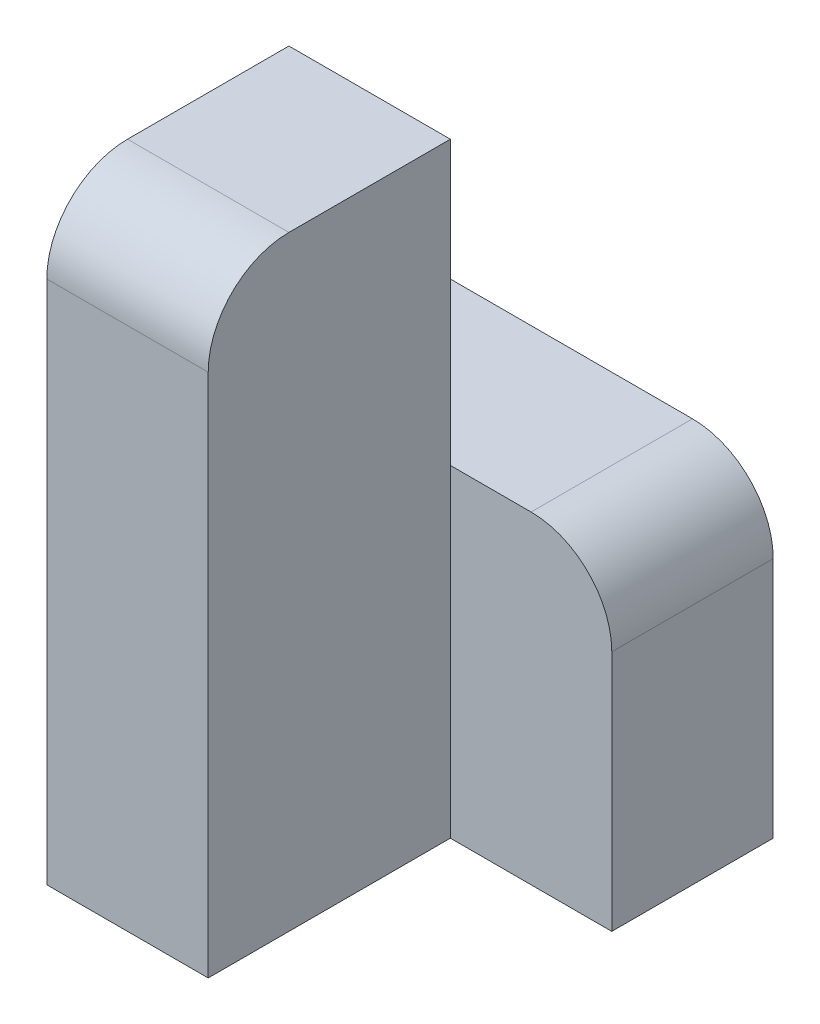
ISO-10303-21;
HEADER;
FILE_DESCRIPTION(('STEP AP214'),'2;1');
FILE_NAME('part.step','',(''),(''),'','','');
FILE_SCHEMA(('AUTOMOTIVE_DESIGN { 1 0 10303 214 1 1 1 1 }'));
ENDSEC;
DATA;
#1=APPLICATION_CONTEXT('core data for automotive mechanical design processes');
#2=APPLICATION_PROTOCOL_DEFINITION('international standard','automotive_design',2000,#1);
#3=PRODUCT_CONTEXT('',#1,'mechanical');
#4=PRODUCT('Part','Part','',(#3));
#5=PRODUCT_RELATED_PRODUCT_CATEGORY('part','',(#4));
#6=PRODUCT_DEFINITION_FORMATION('','',#4);
#7=PRODUCT_DEFINITION_CONTEXT('part definition',#1,'design');
#8=PRODUCT_DEFINITION('design','',#6,#7);
#9=PRODUCT_DEFINITION_SHAPE('','',#8);
#10=(LENGTH_UNIT() NAMED_UNIT(*) SI_UNIT(.MILLI.,.METRE.));
#11=(NAMED_UNIT(*) PLANE_ANGLE_UNIT() SI_UNIT($,.RADIAN.));
#12=(NAMED_UNIT(*) SI_UNIT($,.STERADIAN.) SOLID_ANGLE_UNIT());
#13=UNCERTAINTY_MEASURE_WITH_UNIT(LENGTH_MEASURE(1.E-05),#10,'distance_accuracy_value','');
#14=(GEOMETRIC_REPRESENTATION_CONTEXT(3) GLOBAL_UNCERTAINTY_ASSIGNED_CONTEXT((#13)) GLOBAL_UNIT_ASSIGNED_CONTEXT((#10,
#11,#12)) REPRESENTATION_CONTEXT('',''));
#15=CARTESIAN_POINT('',(0.,0.,0.));
#16=DIRECTION('',(0.,0.,1.));
#17=DIRECTION('',(1.,0.,0.));
#18=AXIS2_PLACEMENT_3D('',#15,#16,#17);
#19=CARTESIAN_POINT('',(-10.,0.,30.));
#20=DIRECTION('',(0.,-1.,0.));
#21=DIRECTION('',(1.,0.,0.));
#22=AXIS2_PLACEMENT_3D('',#19,#20,#21);
#23=PLANE('',#22);
#24=DIRECTION('',(0.,0.,-1.));
#25=VECTOR('',#24,1.);
#26=CARTESIAN_POINT('',(-30.,0.,30.));
#27=LINE('',#26,#25);
#28=CARTESIAN_POINT('',(-30.,0.,20.));
#29=VERTEX_POINT('',#28);
#30=CARTESIAN_POINT('',(-30.,0.,0.));
#31=VERTEX_POINT('',#30);
#32=EDGE_CURVE('E171',#29,#31,#27,.T.);
#33=ORIENTED_EDGE('',*,*,#32,.F.);
#34=DIRECTION('',(-1.,0.,0.));
#35=VECTOR('',#34,1.);
#36=CARTESIAN_POINT('',(-10.,0.,20.));
#37=LINE('',#36,#35);
#38=CARTESIAN_POINT('',(-10.,0.,20.));
#39=VERTEX_POINT('',#38);
#40=EDGE_CURVE('E43',#29,#39,#37,.F.);
#41=ORIENTED_EDGE('',*,*,#40,.T.);
#42=DIRECTION('',(0.,0.,-1.));
#43=VECTOR('',#42,1.);
#44=CARTESIAN_POINT('',(-10.,0.,30.));
#45=LINE('',#44,#43);
#46=CARTESIAN_POINT('',(-10.,0.,0.));
#47=VERTEX_POINT('',#46);
#48=EDGE_CURVE('E158',#39,#47,#45,.T.);
#49=ORIENTED_EDGE('',*,*,#48,.T.);
#50=DIRECTION('',(-1.,0.,0.));
#51=VECTOR('',#50,1.);
#52=CARTESIAN_POINT('',(-10.,0.,0.));
#53=LINE('',#52,#51);
#54=EDGE_CURVE('E148',#47,#31,#53,.T.);
#55=ORIENTED_EDGE('',*,*,#54,.T.);
#56=EDGE_LOOP('',(#33,#41,#49,#55));
#57=FACE_BOUND('',#56,.T.);
#58=ADVANCED_FACE('F35',(#57),#23,.F.);
#59=CARTESIAN_POINT('',(-30.,0.,30.));
#60=DIRECTION('',(1.,0.,0.));
#61=DIRECTION('',(0.,0.,-1.));
#62=AXIS2_PLACEMENT_3D('',#59,#60,#61);
#63=PLANE('',#62);
#64=DIRECTION('',(0.,-1.,0.));
#65=VECTOR('',#64,1.);
#66=CARTESIAN_POINT('',(-30.,0.,30.));
#67=LINE('',#66,#65);
#68=CARTESIAN_POINT('',(-30.,-10.,30.));
#69=VERTEX_POINT('',#68);
#70=CARTESIAN_POINT('',(-30.,-75.,30.));
#71=VERTEX_POINT('',#70);
#72=EDGE_CURVE('E150',#69,#71,#67,.T.);
#73=ORIENTED_EDGE('',*,*,#72,.F.);
#74=CARTESIAN_POINT('',(-30.,-10.,20.));
#75=DIRECTION('',(1.,0.,0.));
#76=DIRECTION('',(0.,0.,-1.));
#77=AXIS2_PLACEMENT_3D('',#74,#75,#76);
#78=CIRCLE('',#77,10.);
#79=EDGE_CURVE('E57',#69,#29,#78,.F.);
#80=ORIENTED_EDGE('',*,*,#79,.T.);
#81=ORIENTED_EDGE('',*,*,#32,.T.);
#82=DIRECTION('',(0.,-1.,0.));
#83=VECTOR('',#82,1.);
#84=CARTESIAN_POINT('',(-30.,0.,0.));
#85=LINE('',#84,#83);
#86=CARTESIAN_POINT('',(-30.,-35.,0.));
#87=VERTEX_POINT('',#86);
#88=EDGE_CURVE('E126',#31,#87,#85,.T.);
#89=ORIENTED_EDGE('',*,*,#88,.T.);
#90=DIRECTION('',(0.,0.,1.));
#91=VECTOR('',#90,1.);
#92=CARTESIAN_POINT('',(-30.,-35.,-20.));
#93=LINE('',#92,#91);
#94=CARTESIAN_POINT('',(-30.,-35.,-20.));
#95=VERTEX_POINT('',#94);
#96=EDGE_CURVE('E111',#95,#87,#93,.T.);
#97=ORIENTED_EDGE('',*,*,#96,.F.);
#98=DIRECTION('',(0.,-1.,0.));
#99=VECTOR('',#98,1.);
#100=CARTESIAN_POINT('',(-30.,-35.,-20.));
#101=LINE('',#100,#99);
#102=CARTESIAN_POINT('',(-30.,-75.,-20.));
#103=VERTEX_POINT('',#102);
#104=EDGE_CURVE('E118',#95,#103,#101,.T.);
#105=ORIENTED_EDGE('',*,*,#104,.T.);
#106=DIRECTION('',(0.,0.,-1.));
#107=VECTOR('',#106,1.);
#108=CARTESIAN_POINT('',(-30.,-75.,30.));
#109=LINE('',#108,#107);
#110=EDGE_CURVE('E169',#71,#103,#109,.T.);
#111=ORIENTED_EDGE('',*,*,#110,.F.);
#112=EDGE_LOOP('',(#73,#80,#81,#89,#97,#105,#111));
#113=FACE_BOUND('',#112,.T.);
#114=ADVANCED_FACE('F123',(#113),#63,.F.);
#115=CARTESIAN_POINT('',(-30.,-75.,30.));
#116=DIRECTION('',(0.,1.,0.));
#117=DIRECTION('',(0.,0.,1.));
#118=AXIS2_PLACEMENT_3D('',#115,#116,#117);
#119=PLANE('',#118);
#120=ORIENTED_EDGE('',*,*,#110,.T.);
#121=DIRECTION('',(1.,0.,0.));
#122=VECTOR('',#121,1.);
#123=CARTESIAN_POINT('',(-30.,-75.,-20.));
#124=LINE('',#123,#122);
#125=CARTESIAN_POINT('',(10.,-75.,-20.));
#126=VERTEX_POINT('',#125);
#127=EDGE_CURVE('E134',#103,#126,#124,.T.);
#128=ORIENTED_EDGE('',*,*,#127,.T.);
#129=DIRECTION('',(0.,0.,1.));
#130=VECTOR('',#129,1.);
#131=CARTESIAN_POINT('',(10.,-75.,-20.));
#132=LINE('',#131,#130);
#133=CARTESIAN_POINT('',(10.,-75.,0.));
#134=VERTEX_POINT('',#133);
#135=EDGE_CURVE('E127',#126,#134,#132,.T.);
#136=ORIENTED_EDGE('',*,*,#135,.T.);
#137=DIRECTION('',(1.,0.,0.));
#138=VECTOR('',#137,1.);
#139=CARTESIAN_POINT('',(-30.,-75.,0.));
#140=LINE('',#139,#138);
#141=CARTESIAN_POINT('',(-10.,-75.,0.));
#142=VERTEX_POINT('',#141);
#143=EDGE_CURVE('E142',#142,#134,#140,.T.);
#144=ORIENTED_EDGE('',*,*,#143,.F.);
#145=DIRECTION('',(0.,0.,-1.));
#146=VECTOR('',#145,1.);
#147=CARTESIAN_POINT('',(-10.,-75.,30.));
#148=LINE('',#147,#146);
#149=CARTESIAN_POINT('',(-10.,-75.,30.));
#150=VERTEX_POINT('',#149);
#151=EDGE_CURVE('E166',#150,#142,#148,.T.);
#152=ORIENTED_EDGE('',*,*,#151,.F.);
#153=DIRECTION('',(1.,0.,0.));
#154=VECTOR('',#153,1.);
#155=CARTESIAN_POINT('',(-30.,-75.,30.));
#156=LINE('',#155,#154);
#157=EDGE_CURVE('E152',#71,#150,#156,.T.);
#158=ORIENTED_EDGE('',*,*,#157,.F.);
#159=EDGE_LOOP('',(#120,#128,#136,#144,#152,#158));
#160=FACE_BOUND('',#159,.T.);
#161=ADVANCED_FACE('F193',(#160),#119,.F.);
#162=CARTESIAN_POINT('',(-10.,-75.,30.));
#163=DIRECTION('',(-1.,0.,0.));
#164=DIRECTION('',(0.,0.,1.));
#165=AXIS2_PLACEMENT_3D('',#162,#163,#164);
#166=PLANE('',#165);
#167=ORIENTED_EDGE('',*,*,#48,.F.);
#168=CARTESIAN_POINT('',(-10.,-10.,20.));
#169=DIRECTION('',(-1.,0.,0.));
#170=DIRECTION('',(0.,0.,1.));
#171=AXIS2_PLACEMENT_3D('',#168,#169,#170);
#172=CIRCLE('',#171,10.);
#173=CARTESIAN_POINT('',(-10.,-9.99999999999999,30.));
#174=VERTEX_POINT('',#173);
#175=EDGE_CURVE('E11',#39,#174,#172,.F.);
#176=ORIENTED_EDGE('',*,*,#175,.T.);
#177=DIRECTION('',(0.,1.,0.));
#178=VECTOR('',#177,1.);
#179=CARTESIAN_POINT('',(-10.,-75.,30.));
#180=LINE('',#179,#178);
#181=EDGE_CURVE('E155',#150,#174,#180,.T.);
#182=ORIENTED_EDGE('',*,*,#181,.F.);
#183=ORIENTED_EDGE('',*,*,#151,.T.);
#184=DIRECTION('',(0.,1.,0.));
#185=VECTOR('',#184,1.);
#186=CARTESIAN_POINT('',(-10.,-75.,0.));
#187=LINE('',#186,#185);
#188=CARTESIAN_POINT('',(-10.,-35.,0.));
#189=VERTEX_POINT('',#188);
#190=EDGE_CURVE('E153',#142,#189,#187,.T.);
#191=ORIENTED_EDGE('',*,*,#190,.T.);
#192=EDGE_CURVE('E162',#189,#47,#187,.T.);
#193=ORIENTED_EDGE('',*,*,#192,.T.);
#194=EDGE_LOOP('',(#167,#176,#182,#183,#191,#193));
#195=FACE_BOUND('',#194,.T.);
#196=ADVANCED_FACE('F196',(#195),#166,.F.);
#197=CARTESIAN_POINT('',(0.,0.,30.));
#198=DIRECTION('',(0.,0.,1.));
#199=DIRECTION('',(1.,0.,0.));
#200=AXIS2_PLACEMENT_3D('',#197,#198,#199);
#201=PLANE('',#200);
#202=ORIENTED_EDGE('',*,*,#181,.T.);
#203=DIRECTION('',(-1.,0.,0.));
#204=VECTOR('',#203,1.);
#205=CARTESIAN_POINT('',(-30.,-10.,30.));
#206=LINE('',#205,#204);
#207=EDGE_CURVE('E181',#174,#69,#206,.T.);
#208=ORIENTED_EDGE('',*,*,#207,.T.);
#209=ORIENTED_EDGE('',*,*,#72,.T.);
#210=ORIENTED_EDGE('',*,*,#157,.T.);
#211=EDGE_LOOP('',(#202,#208,#209,#210));
#212=FACE_BOUND('',#211,.T.);
#213=ADVANCED_FACE('F186',(#212),#201,.T.);
#214=CARTESIAN_POINT('',(0.,0.,0.));
#215=DIRECTION('',(0.,0.,1.));
#216=DIRECTION('',(1.,0.,0.));
#217=AXIS2_PLACEMENT_3D('',#214,#215,#216);
#218=PLANE('',#217);
#219=ORIENTED_EDGE('',*,*,#192,.F.);
#220=DIRECTION('',(-1.,0.,0.));
#221=VECTOR('',#220,1.);
#222=CARTESIAN_POINT('',(10.,-35.,0.));
#223=LINE('',#222,#221);
#224=EDGE_CURVE('E143',#189,#87,#223,.T.);
#225=ORIENTED_EDGE('',*,*,#224,.T.);
#226=ORIENTED_EDGE('',*,*,#88,.F.);
#227=ORIENTED_EDGE('',*,*,#54,.F.);
#228=EDGE_LOOP('',(#219,#225,#226,#227));
#229=FACE_BOUND('',#228,.T.);
#230=ADVANCED_FACE('F215',(#229),#218,.F.);
#231=CARTESIAN_POINT('',(0.,0.,0.));
#232=DIRECTION('',(0.,0.,1.));
#233=DIRECTION('',(1.,0.,0.));
#234=AXIS2_PLACEMENT_3D('',#231,#232,#233);
#235=PLANE('',#234);
#236=DIRECTION('',(0.,1.,0.));
#237=VECTOR('',#236,1.);
#238=CARTESIAN_POINT('',(10.,-75.,0.));
#239=LINE('',#238,#237);
#240=CARTESIAN_POINT('',(10.,-45.,0.));
#241=VERTEX_POINT('',#240);
#242=EDGE_CURVE('E119',#134,#241,#239,.T.);
#243=ORIENTED_EDGE('',*,*,#242,.T.);
#244=CARTESIAN_POINT('',(0.,-45.,0.));
#245=DIRECTION('',(0.,0.,1.));
#246=DIRECTION('',(1.,0.,0.));
#247=AXIS2_PLACEMENT_3D('',#244,#245,#246);
#248=CIRCLE('',#247,10.);
#249=CARTESIAN_POINT('',(0.,-35.,0.));
#250=VERTEX_POINT('',#249);
#251=EDGE_CURVE('E176',#241,#250,#248,.T.);
#252=ORIENTED_EDGE('',*,*,#251,.T.);
#253=EDGE_CURVE('E140',#250,#189,#223,.T.);
#254=ORIENTED_EDGE('',*,*,#253,.T.);
#255=ORIENTED_EDGE('',*,*,#190,.F.);
#256=ORIENTED_EDGE('',*,*,#143,.T.);
#257=EDGE_LOOP('',(#243,#252,#254,#255,#256));
#258=FACE_BOUND('',#257,.T.);
#259=ADVANCED_FACE('F218',(#258),#235,.T.);
#260=CARTESIAN_POINT('',(10.,-35.,-20.));
#261=DIRECTION('',(0.,1.,0.));
#262=DIRECTION('',(-1.,0.,0.));
#263=AXIS2_PLACEMENT_3D('',#260,#261,#262);
#264=PLANE('',#263);
#265=ORIENTED_EDGE('',*,*,#253,.F.);
#266=DIRECTION('',(0.,0.,1.));
#267=VECTOR('',#266,1.);
#268=CARTESIAN_POINT('',(0.,-35.,-20.));
#269=LINE('',#268,#267);
#270=CARTESIAN_POINT('',(0.,-35.,-20.));
#271=VERTEX_POINT('',#270);
#272=EDGE_CURVE('E114',#250,#271,#269,.F.);
#273=ORIENTED_EDGE('',*,*,#272,.T.);
#274=DIRECTION('',(-1.,0.,0.));
#275=VECTOR('',#274,1.);
#276=CARTESIAN_POINT('',(10.,-35.,-20.));
#277=LINE('',#276,#275);
#278=EDGE_CURVE('E106',#271,#95,#277,.T.);
#279=ORIENTED_EDGE('',*,*,#278,.T.);
#280=ORIENTED_EDGE('',*,*,#96,.T.);
#281=ORIENTED_EDGE('',*,*,#224,.F.);
#282=EDGE_LOOP('',(#265,#273,#279,#280,#281));
#283=FACE_BOUND('',#282,.T.);
#284=ADVANCED_FACE('F109',(#283),#264,.T.);
#285=CARTESIAN_POINT('',(10.,-75.,-20.));
#286=DIRECTION('',(1.,0.,0.));
#287=DIRECTION('',(0.,0.,-1.));
#288=AXIS2_PLACEMENT_3D('',#285,#286,#287);
#289=PLANE('',#288);
#290=DIRECTION('',(0.,1.,0.));
#291=VECTOR('',#290,1.);
#292=CARTESIAN_POINT('',(10.,-75.,-20.));
#293=LINE('',#292,#291);
#294=CARTESIAN_POINT('',(10.,-45.,-20.));
#295=VERTEX_POINT('',#294);
#296=EDGE_CURVE('E128',#126,#295,#293,.T.);
#297=ORIENTED_EDGE('',*,*,#296,.T.);
#298=DIRECTION('',(0.,0.,1.));
#299=VECTOR('',#298,1.);
#300=CARTESIAN_POINT('',(10.,-45.,-20.));
#301=LINE('',#300,#299);
#302=EDGE_CURVE('E173',#295,#241,#301,.T.);
#303=ORIENTED_EDGE('',*,*,#302,.T.);
#304=ORIENTED_EDGE('',*,*,#242,.F.);
#305=ORIENTED_EDGE('',*,*,#135,.F.);
#306=EDGE_LOOP('',(#297,#303,#304,#305));
#307=FACE_BOUND('',#306,.T.);
#308=ADVANCED_FACE('F224',(#307),#289,.T.);
#309=CARTESIAN_POINT('',(0.,0.,-20.));
#310=DIRECTION('',(0.,0.,1.));
#311=DIRECTION('',(1.,0.,0.));
#312=AXIS2_PLACEMENT_3D('',#309,#310,#311);
#313=PLANE('',#312);
#314=ORIENTED_EDGE('',*,*,#278,.F.);
#315=CARTESIAN_POINT('',(0.,-45.,-20.));
#316=DIRECTION('',(0.,0.,1.));
#317=DIRECTION('',(1.,0.,0.));
#318=AXIS2_PLACEMENT_3D('',#315,#316,#317);
#319=CIRCLE('',#318,10.);
#320=EDGE_CURVE('E179',#271,#295,#319,.F.);
#321=ORIENTED_EDGE('',*,*,#320,.T.);
#322=ORIENTED_EDGE('',*,*,#296,.F.);
#323=ORIENTED_EDGE('',*,*,#127,.F.);
#324=ORIENTED_EDGE('',*,*,#104,.F.);
#325=EDGE_LOOP('',(#314,#321,#322,#323,#324));
#326=FACE_BOUND('',#325,.T.);
#327=ADVANCED_FACE('F131',(#326),#313,.F.);
#328=CARTESIAN_POINT('',(0.,-45.,-20.));
#329=DIRECTION('',(0.,0.,1.));
#330=DIRECTION('',(1.,0.,0.));
#331=AXIS2_PLACEMENT_3D('',#328,#329,#330);
#332=CYLINDRICAL_SURFACE('',#331,10.);
#333=ORIENTED_EDGE('',*,*,#320,.F.);
#334=ORIENTED_EDGE('',*,*,#272,.F.);
#335=ORIENTED_EDGE('',*,*,#251,.F.);
#336=ORIENTED_EDGE('',*,*,#302,.F.);
#337=EDGE_LOOP('',(#333,#334,#335,#336));
#338=FACE_BOUND('',#337,.T.);
#339=ADVANCED_FACE('F199',(#338),#332,.T.);
#340=CARTESIAN_POINT('',(0.,-10.,20.));
#341=DIRECTION('',(1.,0.,0.));
#342=DIRECTION('',(0.,1.,0.));
#343=AXIS2_PLACEMENT_3D('',#340,#341,#342);
#344=CYLINDRICAL_SURFACE('',#343,10.);
#345=ORIENTED_EDGE('',*,*,#175,.F.);
#346=ORIENTED_EDGE('',*,*,#40,.F.);
#347=ORIENTED_EDGE('',*,*,#79,.F.);
#348=ORIENTED_EDGE('',*,*,#207,.F.);
#349=EDGE_LOOP('',(#345,#346,#347,#348));
#350=FACE_BOUND('',#349,.T.);
#351=ADVANCED_FACE('F37',(#350),#344,.T.);
#352=CLOSED_SHELL('',(#58,#114,#161,#196,#213,#230,#259,#284,#308,#327,#339,#351));
#353=MANIFOLD_SOLID_BREP('B2',#352);
#354=ADVANCED_BREP_SHAPE_REPRESENTATION('',(#18,#353),#14);
#355=SHAPE_DEFINITION_REPRESENTATION(#9,#354);
ENDSEC;
END-ISO-10303-21;
